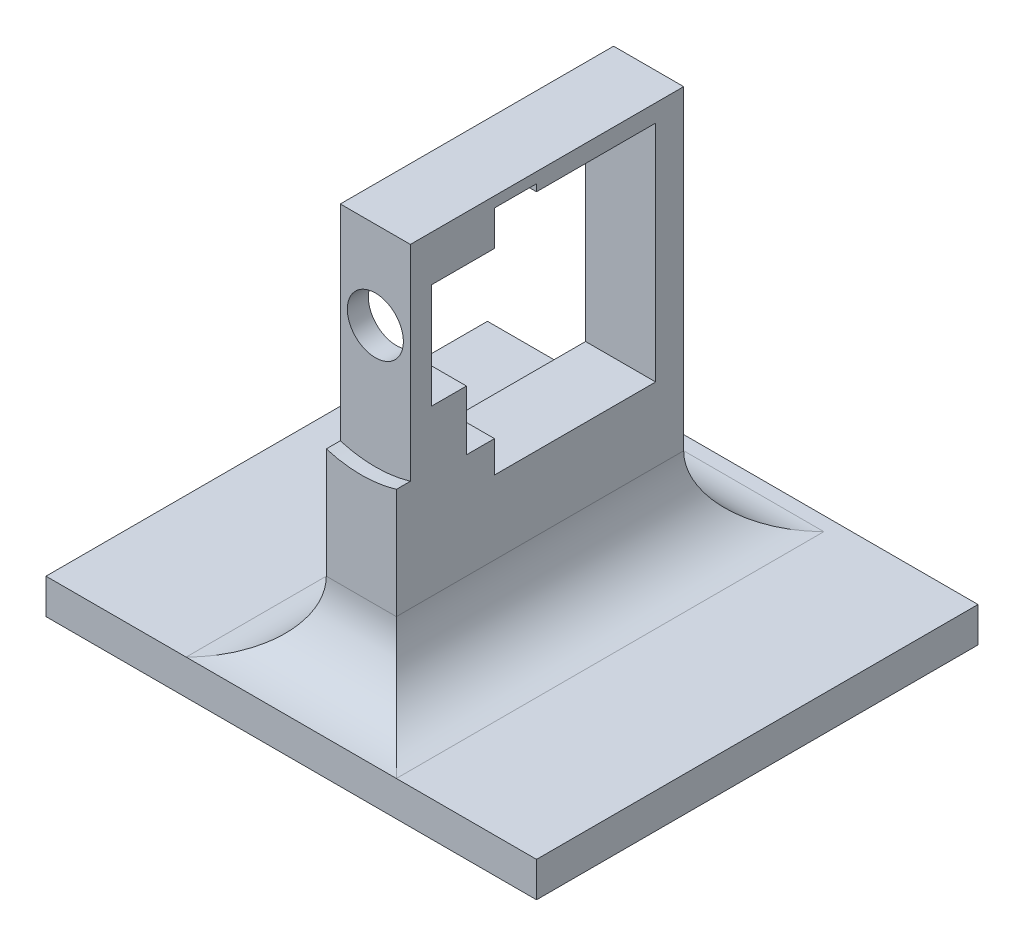
ISO-10303-21;
HEADER;
FILE_DESCRIPTION(('STEP AP214'),'2;1');
FILE_NAME('part.step','',(''),(''),'','','');
FILE_SCHEMA(('AUTOMOTIVE_DESIGN { 1 0 10303 214 1 1 1 1 }'));
ENDSEC;
DATA;
#1=APPLICATION_CONTEXT('core data for automotive mechanical design processes');
#2=APPLICATION_PROTOCOL_DEFINITION('international standard','automotive_design',2000,#1);
#3=PRODUCT_CONTEXT('',#1,'mechanical');
#4=PRODUCT('Part','Part','',(#3));
#5=PRODUCT_RELATED_PRODUCT_CATEGORY('part','',(#4));
#6=PRODUCT_DEFINITION_FORMATION('','',#4);
#7=PRODUCT_DEFINITION_CONTEXT('part definition',#1,'design');
#8=PRODUCT_DEFINITION('design','',#6,#7);
#9=PRODUCT_DEFINITION_SHAPE('','',#8);
#10=(LENGTH_UNIT() NAMED_UNIT(*) SI_UNIT(.MILLI.,.METRE.));
#11=(NAMED_UNIT(*) PLANE_ANGLE_UNIT() SI_UNIT($,.RADIAN.));
#12=(NAMED_UNIT(*) SI_UNIT($,.STERADIAN.) SOLID_ANGLE_UNIT());
#13=UNCERTAINTY_MEASURE_WITH_UNIT(LENGTH_MEASURE(1.E-05),#10,'distance_accuracy_value','');
#14=(GEOMETRIC_REPRESENTATION_CONTEXT(3) GLOBAL_UNCERTAINTY_ASSIGNED_CONTEXT((#13)) GLOBAL_UNIT_ASSIGNED_CONTEXT((#10,
#11,#12)) REPRESENTATION_CONTEXT('',''));
#15=CARTESIAN_POINT('',(0.,0.,0.));
#16=DIRECTION('',(0.,0.,1.));
#17=DIRECTION('',(1.,0.,0.));
#18=AXIS2_PLACEMENT_3D('',#15,#16,#17);
#19=CARTESIAN_POINT('',(5.,2.5,-10.));
#20=DIRECTION('',(1.,0.,0.));
#21=DIRECTION('',(0.,1.,0.));
#22=AXIS2_PLACEMENT_3D('',#19,#20,#21);
#23=PLANE('',#22);
#24=DIRECTION('',(0.,1.,0.));
#25=VECTOR('',#24,1.);
#26=CARTESIAN_POINT('',(5.,2.5,10.));
#27=LINE('',#26,#25);
#28=CARTESIAN_POINT('',(5.,12.5,10.));
#29=VERTEX_POINT('',#28);
#30=CARTESIAN_POINT('',(5.,28.2294901687516,10.));
#31=VERTEX_POINT('',#30);
#32=EDGE_CURVE('E332',#29,#31,#27,.T.);
#33=ORIENTED_EDGE('',*,*,#32,.F.);
#34=DIRECTION('',(0.,0.,1.));
#35=VECTOR('',#34,1.);
#36=CARTESIAN_POINT('',(5.,12.5,-31.));
#37=LINE('',#36,#35);
#38=CARTESIAN_POINT('',(5.,12.5,-31.));
#39=VERTEX_POINT('',#38);
#40=EDGE_CURVE('E11',#29,#39,#37,.F.);
#41=ORIENTED_EDGE('',*,*,#40,.T.);
#42=DIRECTION('',(0.,-1.,0.));
#43=VECTOR('',#42,1.);
#44=CARTESIAN_POINT('',(5.,0.,-31.));
#45=LINE('',#44,#43);
#46=CARTESIAN_POINT('',(5.,57.5,-31.));
#47=VERTEX_POINT('',#46);
#48=EDGE_CURVE('E218',#47,#39,#45,.T.);
#49=ORIENTED_EDGE('',*,*,#48,.F.);
#50=DIRECTION('',(0.,0.,1.));
#51=VECTOR('',#50,1.);
#52=CARTESIAN_POINT('',(5.,57.5,-10.));
#53=LINE('',#52,#51);
#54=CARTESIAN_POINT('',(5.,57.5,8.));
#55=VERTEX_POINT('',#54);
#56=EDGE_CURVE('E209',#47,#55,#53,.T.);
#57=ORIENTED_EDGE('',*,*,#56,.T.);
#58=DIRECTION('',(0.,-1.,0.));
#59=VECTOR('',#58,1.);
#60=CARTESIAN_POINT('',(5.,2.5,8.));
#61=LINE('',#60,#59);
#62=CARTESIAN_POINT('',(5.,28.2294901687516,8.));
#63=VERTEX_POINT('',#62);
#64=EDGE_CURVE('E329',#55,#63,#61,.T.);
#65=ORIENTED_EDGE('',*,*,#64,.T.);
#66=DIRECTION('',(0.,0.,-1.));
#67=VECTOR('',#66,1.);
#68=CARTESIAN_POINT('',(5.,28.2294901687516,20.));
#69=LINE('',#68,#67);
#70=EDGE_CURVE('E325',#63,#31,#69,.F.);
#71=ORIENTED_EDGE('',*,*,#70,.T.);
#72=EDGE_LOOP('',(#33,#41,#49,#57,#65,#71));
#73=FACE_BOUND('',#72,.T.);
#74=DIRECTION('',(0.,-1.,0.));
#75=VECTOR('',#74,1.);
#76=CARTESIAN_POINT('',(5.,0.,-3.99999999999999));
#77=LINE('',#76,#75);
#78=CARTESIAN_POINT('',(5.,56.,-4.));
#79=VERTEX_POINT('',#78);
#80=CARTESIAN_POINT('',(5.,51.,-4.));
#81=VERTEX_POINT('',#80);
#82=EDGE_CURVE('E301',#79,#81,#77,.T.);
#83=ORIENTED_EDGE('',*,*,#82,.F.);
#84=DIRECTION('',(0.,0.,1.));
#85=VECTOR('',#84,1.);
#86=CARTESIAN_POINT('',(5.,56.,-1.29526019539602E-13));
#87=LINE('',#86,#85);
#88=CARTESIAN_POINT('',(5.,56.,-10.));
#89=VERTEX_POINT('',#88);
#90=EDGE_CURVE('E296',#89,#79,#87,.T.);
#91=ORIENTED_EDGE('',*,*,#90,.F.);
#92=DIRECTION('',(0.,-1.,0.));
#93=VECTOR('',#92,1.);
#94=CARTESIAN_POINT('',(5.,0.,-10.));
#95=LINE('',#94,#93);
#96=CARTESIAN_POINT('',(5.,55.,-10.));
#97=VERTEX_POINT('',#96);
#98=EDGE_CURVE('E240',#89,#97,#95,.T.);
#99=ORIENTED_EDGE('',*,*,#98,.T.);
#100=DIRECTION('',(0.,0.,-1.));
#101=VECTOR('',#100,1.);
#102=CARTESIAN_POINT('',(5.,55.,0.));
#103=LINE('',#102,#101);
#104=CARTESIAN_POINT('',(5.,55.,-27.));
#105=VERTEX_POINT('',#104);
#106=EDGE_CURVE('E232',#97,#105,#103,.T.);
#107=ORIENTED_EDGE('',*,*,#106,.T.);
#108=DIRECTION('',(0.,-1.,0.));
#109=VECTOR('',#108,1.);
#110=CARTESIAN_POINT('',(5.,0.,-27.));
#111=LINE('',#110,#109);
#112=CARTESIAN_POINT('',(5.,23.,-27.));
#113=VERTEX_POINT('',#112);
#114=EDGE_CURVE('E226',#105,#113,#111,.T.);
#115=ORIENTED_EDGE('',*,*,#114,.T.);
#116=DIRECTION('',(0.,0.,1.));
#117=VECTOR('',#116,1.);
#118=CARTESIAN_POINT('',(5.,23.,0.));
#119=LINE('',#118,#117);
#120=CARTESIAN_POINT('',(5.,23.,-4.));
#121=VERTEX_POINT('',#120);
#122=EDGE_CURVE('E262',#113,#121,#119,.T.);
#123=ORIENTED_EDGE('',*,*,#122,.T.);
#124=DIRECTION('',(0.,-1.,0.));
#125=VECTOR('',#124,1.);
#126=CARTESIAN_POINT('',(5.,0.,-3.99999999999999));
#127=LINE('',#126,#125);
#128=CARTESIAN_POINT('',(5.,27.5,-4.));
#129=VERTEX_POINT('',#128);
#130=EDGE_CURVE('E253',#129,#121,#127,.T.);
#131=ORIENTED_EDGE('',*,*,#130,.F.);
#132=DIRECTION('',(0.,0.,1.));
#133=VECTOR('',#132,1.);
#134=CARTESIAN_POINT('',(5.,27.5,0.));
#135=LINE('',#134,#133);
#136=CARTESIAN_POINT('',(5.00000000000002,27.5,0.));
#137=VERTEX_POINT('',#136);
#138=EDGE_CURVE('E257',#129,#137,#135,.T.);
#139=ORIENTED_EDGE('',*,*,#138,.T.);
#140=DIRECTION('',(0.,-1.,0.));
#141=VECTOR('',#140,1.);
#142=CARTESIAN_POINT('',(5.,0.,0.));
#143=LINE('',#142,#141);
#144=CARTESIAN_POINT('',(5.,36.,0.));
#145=VERTEX_POINT('',#144);
#146=EDGE_CURVE('E286',#145,#137,#143,.T.);
#147=ORIENTED_EDGE('',*,*,#146,.F.);
#148=DIRECTION('',(0.,0.,1.));
#149=VECTOR('',#148,1.);
#150=CARTESIAN_POINT('',(5.,36.,0.));
#151=LINE('',#150,#149);
#152=CARTESIAN_POINT('',(5.,36.,5.));
#153=VERTEX_POINT('',#152);
#154=EDGE_CURVE('E282',#145,#153,#151,.T.);
#155=ORIENTED_EDGE('',*,*,#154,.T.);
#156=DIRECTION('',(0.,-1.,0.));
#157=VECTOR('',#156,1.);
#158=CARTESIAN_POINT('',(5.,0.,5.00000000000001));
#159=LINE('',#158,#157);
#160=CARTESIAN_POINT('',(5.,51.,5.));
#161=VERTEX_POINT('',#160);
#162=EDGE_CURVE('E305',#161,#153,#159,.T.);
#163=ORIENTED_EDGE('',*,*,#162,.F.);
#164=DIRECTION('',(0.,0.,1.));
#165=VECTOR('',#164,1.);
#166=CARTESIAN_POINT('',(5.,51.,0.));
#167=LINE('',#166,#165);
#168=EDGE_CURVE('E303',#81,#161,#167,.T.);
#169=ORIENTED_EDGE('',*,*,#168,.F.);
#170=EDGE_LOOP('',(#83,#91,#99,#107,#115,#123,#131,#139,#147,#155,#163,#169));
#171=FACE_BOUND('',#170,.T.);
#172=ADVANCED_FACE('F37',(#73,#171),#23,.T.);
#173=CARTESIAN_POINT('',(-5.,2.5,-10.));
#174=DIRECTION('',(-1.,0.,0.));
#175=DIRECTION('',(0.,-1.,0.));
#176=AXIS2_PLACEMENT_3D('',#173,#174,#175);
#177=PLANE('',#176);
#178=DIRECTION('',(0.,-1.,0.));
#179=VECTOR('',#178,1.);
#180=CARTESIAN_POINT('',(-5.,0.,-10.));
#181=LINE('',#180,#179);
#182=CARTESIAN_POINT('',(-5.,56.,-10.));
#183=VERTEX_POINT('',#182);
#184=CARTESIAN_POINT('',(-5.,55.,-10.));
#185=VERTEX_POINT('',#184);
#186=EDGE_CURVE('E219',#183,#185,#181,.T.);
#187=ORIENTED_EDGE('',*,*,#186,.F.);
#188=DIRECTION('',(0.,0.,1.));
#189=VECTOR('',#188,1.);
#190=CARTESIAN_POINT('',(-5.00000000000001,56.,-1.29526019539602E-13));
#191=LINE('',#190,#189);
#192=CARTESIAN_POINT('',(-5.00000000000001,56.,-4.));
#193=VERTEX_POINT('',#192);
#194=EDGE_CURVE('E259',#183,#193,#191,.T.);
#195=ORIENTED_EDGE('',*,*,#194,.T.);
#196=DIRECTION('',(0.,-1.,0.));
#197=VECTOR('',#196,1.);
#198=CARTESIAN_POINT('',(-5.,0.,-3.99999999999999));
#199=LINE('',#198,#197);
#200=CARTESIAN_POINT('',(-5.00000000000001,51.,-4.));
#201=VERTEX_POINT('',#200);
#202=EDGE_CURVE('E264',#193,#201,#199,.T.);
#203=ORIENTED_EDGE('',*,*,#202,.T.);
#204=DIRECTION('',(0.,0.,1.));
#205=VECTOR('',#204,1.);
#206=CARTESIAN_POINT('',(-5.00000000000001,51.,0.));
#207=LINE('',#206,#205);
#208=CARTESIAN_POINT('',(-5.00000000000001,51.,5.));
#209=VERTEX_POINT('',#208);
#210=EDGE_CURVE('E268',#201,#209,#207,.T.);
#211=ORIENTED_EDGE('',*,*,#210,.T.);
#212=DIRECTION('',(0.,-1.,0.));
#213=VECTOR('',#212,1.);
#214=CARTESIAN_POINT('',(-5.,0.,5.00000000000001));
#215=LINE('',#214,#213);
#216=CARTESIAN_POINT('',(-5.,36.,5.));
#217=VERTEX_POINT('',#216);
#218=EDGE_CURVE('E272',#209,#217,#215,.T.);
#219=ORIENTED_EDGE('',*,*,#218,.T.);
#220=DIRECTION('',(0.,0.,1.));
#221=VECTOR('',#220,1.);
#222=CARTESIAN_POINT('',(-5.,36.,0.));
#223=LINE('',#222,#221);
#224=CARTESIAN_POINT('',(-5.,36.,0.));
#225=VERTEX_POINT('',#224);
#226=EDGE_CURVE('E258',#225,#217,#223,.T.);
#227=ORIENTED_EDGE('',*,*,#226,.F.);
#228=DIRECTION('',(0.,-1.,0.));
#229=VECTOR('',#228,1.);
#230=CARTESIAN_POINT('',(-5.,0.,0.));
#231=LINE('',#230,#229);
#232=CARTESIAN_POINT('',(-5.,27.5,0.));
#233=VERTEX_POINT('',#232);
#234=EDGE_CURVE('E279',#225,#233,#231,.T.);
#235=ORIENTED_EDGE('',*,*,#234,.T.);
#236=DIRECTION('',(0.,0.,1.));
#237=VECTOR('',#236,1.);
#238=CARTESIAN_POINT('',(-5.,27.5,0.));
#239=LINE('',#238,#237);
#240=CARTESIAN_POINT('',(-5.,27.5,-4.));
#241=VERTEX_POINT('',#240);
#242=EDGE_CURVE('E278',#241,#233,#239,.T.);
#243=ORIENTED_EDGE('',*,*,#242,.F.);
#244=DIRECTION('',(0.,-1.,0.));
#245=VECTOR('',#244,1.);
#246=CARTESIAN_POINT('',(-5.,0.,-3.99999999999999));
#247=LINE('',#246,#245);
#248=CARTESIAN_POINT('',(-5.,23.,-4.));
#249=VERTEX_POINT('',#248);
#250=EDGE_CURVE('E287',#241,#249,#247,.T.);
#251=ORIENTED_EDGE('',*,*,#250,.T.);
#252=DIRECTION('',(0.,0.,1.));
#253=VECTOR('',#252,1.);
#254=CARTESIAN_POINT('',(-5.,23.,0.));
#255=LINE('',#254,#253);
#256=CARTESIAN_POINT('',(-5.,23.,-27.));
#257=VERTEX_POINT('',#256);
#258=EDGE_CURVE('E254',#257,#249,#255,.T.);
#259=ORIENTED_EDGE('',*,*,#258,.F.);
#260=DIRECTION('',(0.,-1.,0.));
#261=VECTOR('',#260,1.);
#262=CARTESIAN_POINT('',(-5.,0.,-27.));
#263=LINE('',#262,#261);
#264=CARTESIAN_POINT('',(-5.,55.,-27.));
#265=VERTEX_POINT('',#264);
#266=EDGE_CURVE('E236',#265,#257,#263,.T.);
#267=ORIENTED_EDGE('',*,*,#266,.F.);
#268=DIRECTION('',(0.,0.,-1.));
#269=VECTOR('',#268,1.);
#270=CARTESIAN_POINT('',(-5.,55.,0.));
#271=LINE('',#270,#269);
#272=EDGE_CURVE('E246',#185,#265,#271,.T.);
#273=ORIENTED_EDGE('',*,*,#272,.F.);
#274=EDGE_LOOP('',(#187,#195,#203,#211,#219,#227,#235,#243,#251,#259,#267,#273));
#275=FACE_BOUND('',#274,.T.);
#276=DIRECTION('',(0.,-1.,0.));
#277=VECTOR('',#276,1.);
#278=CARTESIAN_POINT('',(-5.,0.,-31.));
#279=LINE('',#278,#277);
#280=CARTESIAN_POINT('',(-5.,57.5,-31.));
#281=VERTEX_POINT('',#280);
#282=CARTESIAN_POINT('',(-5.,12.5,-31.));
#283=VERTEX_POINT('',#282);
#284=EDGE_CURVE('E203',#281,#283,#279,.T.);
#285=ORIENTED_EDGE('',*,*,#284,.T.);
#286=DIRECTION('',(0.,0.,1.));
#287=VECTOR('',#286,1.);
#288=CARTESIAN_POINT('',(-5.,12.5,10.));
#289=LINE('',#288,#287);
#290=CARTESIAN_POINT('',(-5.,12.5,10.));
#291=VERTEX_POINT('',#290);
#292=EDGE_CURVE('E61',#283,#291,#289,.T.);
#293=ORIENTED_EDGE('',*,*,#292,.T.);
#294=DIRECTION('',(0.,-1.,0.));
#295=VECTOR('',#294,1.);
#296=CARTESIAN_POINT('',(-5.,2.5,10.));
#297=LINE('',#296,#295);
#298=CARTESIAN_POINT('',(-5.,28.2294901687516,10.));
#299=VERTEX_POINT('',#298);
#300=EDGE_CURVE('E334',#299,#291,#297,.T.);
#301=ORIENTED_EDGE('',*,*,#300,.F.);
#302=DIRECTION('',(0.,0.,-1.));
#303=VECTOR('',#302,1.);
#304=CARTESIAN_POINT('',(-5.,28.2294901687516,20.));
#305=LINE('',#304,#303);
#306=CARTESIAN_POINT('',(-5.,28.2294901687516,8.));
#307=VERTEX_POINT('',#306);
#308=EDGE_CURVE('E323',#299,#307,#305,.T.);
#309=ORIENTED_EDGE('',*,*,#308,.T.);
#310=DIRECTION('',(0.,1.,0.));
#311=VECTOR('',#310,1.);
#312=CARTESIAN_POINT('',(-5.,2.5,8.));
#313=LINE('',#312,#311);
#314=CARTESIAN_POINT('',(-5.,57.5,8.));
#315=VERTEX_POINT('',#314);
#316=EDGE_CURVE('E205',#307,#315,#313,.T.);
#317=ORIENTED_EDGE('',*,*,#316,.T.);
#318=DIRECTION('',(0.,0.,1.));
#319=VECTOR('',#318,1.);
#320=CARTESIAN_POINT('',(-5.,57.5,-10.));
#321=LINE('',#320,#319);
#322=EDGE_CURVE('E199',#281,#315,#321,.T.);
#323=ORIENTED_EDGE('',*,*,#322,.F.);
#324=EDGE_LOOP('',(#285,#293,#301,#309,#317,#323));
#325=FACE_BOUND('',#324,.T.);
#326=ADVANCED_FACE('F201',(#275,#325),#177,.T.);
#327=CARTESIAN_POINT('',(5.,57.5,-10.));
#328=DIRECTION('',(0.,1.,0.));
#329=DIRECTION('',(0.,0.,1.));
#330=AXIS2_PLACEMENT_3D('',#327,#328,#329);
#331=PLANE('',#330);
#332=ORIENTED_EDGE('',*,*,#322,.T.);
#333=DIRECTION('',(1.,0.,0.));
#334=VECTOR('',#333,1.);
#335=CARTESIAN_POINT('',(5.,57.5,8.));
#336=LINE('',#335,#334);
#337=EDGE_CURVE('E374',#315,#55,#336,.T.);
#338=ORIENTED_EDGE('',*,*,#337,.T.);
#339=ORIENTED_EDGE('',*,*,#56,.F.);
#340=DIRECTION('',(-1.,0.,0.));
#341=VECTOR('',#340,1.);
#342=CARTESIAN_POINT('',(63.8727441181401,57.5,-31.));
#343=LINE('',#342,#341);
#344=EDGE_CURVE('E212',#47,#281,#343,.T.);
#345=ORIENTED_EDGE('',*,*,#344,.T.);
#346=EDGE_LOOP('',(#332,#338,#339,#345));
#347=FACE_BOUND('',#346,.T.);
#348=ADVANCED_FACE('F213',(#347),#331,.T.);
#349=CARTESIAN_POINT('',(-35.,2.5,-43.));
#350=DIRECTION('',(0.,1.,0.));
#351=DIRECTION('',(0.,0.,1.));
#352=AXIS2_PLACEMENT_3D('',#349,#350,#351);
#353=PLANE('',#352);
#354=DIRECTION('',(-1.,0.,0.));
#355=VECTOR('',#354,1.);
#356=CARTESIAN_POINT('',(-35.,2.5,20.));
#357=LINE('',#356,#355);
#358=CARTESIAN_POINT('',(-15.,2.5,20.));
#359=VERTEX_POINT('',#358);
#360=CARTESIAN_POINT('',(-35.,2.5,20.));
#361=VERTEX_POINT('',#360);
#362=EDGE_CURVE('E339',#359,#361,#357,.T.);
#363=ORIENTED_EDGE('',*,*,#362,.F.);
#364=DIRECTION('',(0.,0.,1.));
#365=VECTOR('',#364,1.);
#366=CARTESIAN_POINT('',(-15.,2.5,-31.));
#367=LINE('',#366,#365);
#368=CARTESIAN_POINT('',(-15.,2.5,-41.));
#369=VERTEX_POINT('',#368);
#370=EDGE_CURVE('E388',#359,#369,#367,.F.);
#371=ORIENTED_EDGE('',*,*,#370,.T.);
#372=DIRECTION('',(-1.,0.,0.));
#373=VECTOR('',#372,1.);
#374=CARTESIAN_POINT('',(5.,2.5,-41.));
#375=LINE('',#374,#373);
#376=CARTESIAN_POINT('',(15.,2.5,-41.));
#377=VERTEX_POINT('',#376);
#378=EDGE_CURVE('E385',#369,#377,#375,.F.);
#379=ORIENTED_EDGE('',*,*,#378,.T.);
#380=DIRECTION('',(0.,0.,1.));
#381=VECTOR('',#380,1.);
#382=CARTESIAN_POINT('',(15.,2.5,10.));
#383=LINE('',#382,#381);
#384=CARTESIAN_POINT('',(15.,2.5,20.));
#385=VERTEX_POINT('',#384);
#386=EDGE_CURVE('E383',#377,#385,#383,.T.);
#387=ORIENTED_EDGE('',*,*,#386,.T.);
#388=CARTESIAN_POINT('',(35.,2.5,20.));
#389=VERTEX_POINT('',#388);
#390=EDGE_CURVE('E340',#389,#385,#357,.T.);
#391=ORIENTED_EDGE('',*,*,#390,.F.);
#392=DIRECTION('',(0.,0.,1.));
#393=VECTOR('',#392,1.);
#394=CARTESIAN_POINT('',(35.,2.5,-43.));
#395=LINE('',#394,#393);
#396=CARTESIAN_POINT('',(35.,2.5,-43.));
#397=VERTEX_POINT('',#396);
#398=EDGE_CURVE('E362',#397,#389,#395,.T.);
#399=ORIENTED_EDGE('',*,*,#398,.F.);
#400=DIRECTION('',(-1.,0.,0.));
#401=VECTOR('',#400,1.);
#402=CARTESIAN_POINT('',(-35.,2.5,-43.));
#403=LINE('',#402,#401);
#404=CARTESIAN_POINT('',(-35.,2.5,-43.));
#405=VERTEX_POINT('',#404);
#406=EDGE_CURVE('E353',#397,#405,#403,.T.);
#407=ORIENTED_EDGE('',*,*,#406,.T.);
#408=DIRECTION('',(0.,0.,1.));
#409=VECTOR('',#408,1.);
#410=CARTESIAN_POINT('',(-35.,2.5,-43.));
#411=LINE('',#410,#409);
#412=EDGE_CURVE('E368',#405,#361,#411,.T.);
#413=ORIENTED_EDGE('',*,*,#412,.T.);
#414=EDGE_LOOP('',(#363,#371,#379,#387,#391,#399,#407,#413));
#415=FACE_BOUND('',#414,.T.);
#416=ADVANCED_FACE('F415',(#415),#353,.T.);
#417=CARTESIAN_POINT('',(35.,2.5,-43.));
#418=DIRECTION('',(1.,0.,0.));
#419=DIRECTION('',(0.,0.,-1.));
#420=AXIS2_PLACEMENT_3D('',#417,#418,#419);
#421=PLANE('',#420);
#422=ORIENTED_EDGE('',*,*,#398,.T.);
#423=DIRECTION('',(0.,1.,0.));
#424=VECTOR('',#423,1.);
#425=CARTESIAN_POINT('',(35.,2.5,20.));
#426=LINE('',#425,#424);
#427=CARTESIAN_POINT('',(35.,-2.5,20.));
#428=VERTEX_POINT('',#427);
#429=EDGE_CURVE('E208',#428,#389,#426,.T.);
#430=ORIENTED_EDGE('',*,*,#429,.F.);
#431=DIRECTION('',(0.,0.,1.));
#432=VECTOR('',#431,1.);
#433=CARTESIAN_POINT('',(35.,-2.5,-43.));
#434=LINE('',#433,#432);
#435=CARTESIAN_POINT('',(35.,-2.5,-43.));
#436=VERTEX_POINT('',#435);
#437=EDGE_CURVE('E363',#436,#428,#434,.T.);
#438=ORIENTED_EDGE('',*,*,#437,.F.);
#439=DIRECTION('',(0.,1.,0.));
#440=VECTOR('',#439,1.);
#441=CARTESIAN_POINT('',(35.,2.5,-43.));
#442=LINE('',#441,#440);
#443=EDGE_CURVE('E350',#436,#397,#442,.T.);
#444=ORIENTED_EDGE('',*,*,#443,.T.);
#445=EDGE_LOOP('',(#422,#430,#438,#444));
#446=FACE_BOUND('',#445,.T.);
#447=ADVANCED_FACE('F425',(#446),#421,.T.);
#448=CARTESIAN_POINT('',(-35.,-2.5,-43.));
#449=DIRECTION('',(0.,-1.,0.));
#450=DIRECTION('',(0.,0.,-1.));
#451=AXIS2_PLACEMENT_3D('',#448,#449,#450);
#452=PLANE('',#451);
#453=ORIENTED_EDGE('',*,*,#437,.T.);
#454=DIRECTION('',(1.,0.,0.));
#455=VECTOR('',#454,1.);
#456=CARTESIAN_POINT('',(-35.,-2.5,20.));
#457=LINE('',#456,#455);
#458=CARTESIAN_POINT('',(-35.,-2.5,20.));
#459=VERTEX_POINT('',#458);
#460=EDGE_CURVE('E347',#459,#428,#457,.T.);
#461=ORIENTED_EDGE('',*,*,#460,.F.);
#462=DIRECTION('',(0.,0.,1.));
#463=VECTOR('',#462,1.);
#464=CARTESIAN_POINT('',(-35.,-2.5,-43.));
#465=LINE('',#464,#463);
#466=CARTESIAN_POINT('',(-35.,-2.5,-43.));
#467=VERTEX_POINT('',#466);
#468=EDGE_CURVE('E366',#467,#459,#465,.T.);
#469=ORIENTED_EDGE('',*,*,#468,.F.);
#470=DIRECTION('',(1.,0.,0.));
#471=VECTOR('',#470,1.);
#472=CARTESIAN_POINT('',(-35.,-2.5,-43.));
#473=LINE('',#472,#471);
#474=EDGE_CURVE('E359',#467,#436,#473,.T.);
#475=ORIENTED_EDGE('',*,*,#474,.T.);
#476=EDGE_LOOP('',(#453,#461,#469,#475));
#477=FACE_BOUND('',#476,.T.);
#478=ADVANCED_FACE('F422',(#477),#452,.T.);
#479=CARTESIAN_POINT('',(-35.,2.5,-43.));
#480=DIRECTION('',(-1.,0.,0.));
#481=DIRECTION('',(0.,0.,1.));
#482=AXIS2_PLACEMENT_3D('',#479,#480,#481);
#483=PLANE('',#482);
#484=ORIENTED_EDGE('',*,*,#468,.T.);
#485=DIRECTION('',(0.,-1.,0.));
#486=VECTOR('',#485,1.);
#487=CARTESIAN_POINT('',(-35.,2.5,20.));
#488=LINE('',#487,#486);
#489=EDGE_CURVE('E343',#361,#459,#488,.T.);
#490=ORIENTED_EDGE('',*,*,#489,.F.);
#491=ORIENTED_EDGE('',*,*,#412,.F.);
#492=DIRECTION('',(0.,-1.,0.));
#493=VECTOR('',#492,1.);
#494=CARTESIAN_POINT('',(-35.,2.5,-43.));
#495=LINE('',#494,#493);
#496=EDGE_CURVE('E356',#405,#467,#495,.T.);
#497=ORIENTED_EDGE('',*,*,#496,.T.);
#498=EDGE_LOOP('',(#484,#490,#491,#497));
#499=FACE_BOUND('',#498,.T.);
#500=ADVANCED_FACE('F419',(#499),#483,.T.);
#501=CARTESIAN_POINT('',(0.,0.,-43.));
#502=DIRECTION('',(0.,0.,1.));
#503=DIRECTION('',(1.,0.,0.));
#504=AXIS2_PLACEMENT_3D('',#501,#502,#503);
#505=PLANE('',#504);
#506=ORIENTED_EDGE('',*,*,#443,.F.);
#507=ORIENTED_EDGE('',*,*,#474,.F.);
#508=ORIENTED_EDGE('',*,*,#496,.F.);
#509=ORIENTED_EDGE('',*,*,#406,.F.);
#510=EDGE_LOOP('',(#506,#507,#508,#509));
#511=FACE_BOUND('',#510,.T.);
#512=ADVANCED_FACE('F454',(#511),#505,.F.);
#513=CARTESIAN_POINT('',(0.,0.,20.));
#514=DIRECTION('',(0.,0.,1.));
#515=DIRECTION('',(1.,0.,0.));
#516=AXIS2_PLACEMENT_3D('',#513,#514,#515);
#517=PLANE('',#516);
#518=ORIENTED_EDGE('',*,*,#429,.T.);
#519=ORIENTED_EDGE('',*,*,#390,.T.);
#520=EDGE_CURVE('E344',#385,#359,#357,.T.);
#521=ORIENTED_EDGE('',*,*,#520,.T.);
#522=ORIENTED_EDGE('',*,*,#362,.T.);
#523=ORIENTED_EDGE('',*,*,#489,.T.);
#524=ORIENTED_EDGE('',*,*,#460,.T.);
#525=EDGE_LOOP('',(#518,#519,#521,#522,#523,#524));
#526=FACE_BOUND('',#525,.T.);
#527=ADVANCED_FACE('F411',(#526),#517,.T.);
#528=CARTESIAN_POINT('',(0.,0.,10.));
#529=DIRECTION('',(0.,0.,1.));
#530=DIRECTION('',(1.,0.,0.));
#531=AXIS2_PLACEMENT_3D('',#528,#529,#530);
#532=PLANE('',#531);
#533=ORIENTED_EDGE('',*,*,#300,.T.);
#534=DIRECTION('',(1.,0.,0.));
#535=VECTOR('',#534,1.);
#536=CARTESIAN_POINT('',(5.,12.5,10.));
#537=LINE('',#536,#535);
#538=EDGE_CURVE('E46',#291,#29,#537,.T.);
#539=ORIENTED_EDGE('',*,*,#538,.T.);
#540=ORIENTED_EDGE('',*,*,#32,.T.);
#541=CARTESIAN_POINT('',(0.,45.,10.));
#542=DIRECTION('',(0.,0.,1.));
#543=DIRECTION('',(1.,0.,0.));
#544=AXIS2_PLACEMENT_3D('',#541,#542,#543);
#545=CIRCLE('',#544,17.5);
#546=EDGE_CURVE('E365',#31,#299,#545,.F.);
#547=ORIENTED_EDGE('',*,*,#546,.T.);
#548=EDGE_LOOP('',(#533,#539,#540,#547));
#549=FACE_BOUND('',#548,.T.);
#550=ADVANCED_FACE('F453',(#549),#532,.T.);
#551=CARTESIAN_POINT('',(0.,45.,20.));
#552=DIRECTION('',(0.,0.,-1.));
#553=DIRECTION('',(-1.,0.,0.));
#554=AXIS2_PLACEMENT_3D('',#551,#552,#553);
#555=CYLINDRICAL_SURFACE('',#554,17.5);
#556=CARTESIAN_POINT('',(0.,45.,8.));
#557=DIRECTION('',(0.,0.,1.));
#558=DIRECTION('',(1.,0.,0.));
#559=AXIS2_PLACEMENT_3D('',#556,#557,#558);
#560=CIRCLE('',#559,17.5);
#561=EDGE_CURVE('E290',#307,#63,#560,.T.);
#562=ORIENTED_EDGE('',*,*,#561,.F.);
#563=ORIENTED_EDGE('',*,*,#308,.F.);
#564=ORIENTED_EDGE('',*,*,#546,.F.);
#565=ORIENTED_EDGE('',*,*,#70,.F.);
#566=EDGE_LOOP('',(#562,#563,#564,#565));
#567=FACE_BOUND('',#566,.T.);
#568=ADVANCED_FACE('F540',(#567),#555,.F.);
#569=CARTESIAN_POINT('',(0.,0.,8.));
#570=DIRECTION('',(0.,0.,1.));
#571=DIRECTION('',(1.,0.,0.));
#572=AXIS2_PLACEMENT_3D('',#569,#570,#571);
#573=PLANE('',#572);
#574=CARTESIAN_POINT('',(0.,45.,8.));
#575=DIRECTION('',(0.,0.,1.));
#576=DIRECTION('',(1.,0.,0.));
#577=AXIS2_PLACEMENT_3D('',#574,#575,#576);
#578=CIRCLE('',#577,4.);
#579=CARTESIAN_POINT('',(4.,45.,8.));
#580=VERTEX_POINT('',#579);
#581=EDGE_CURVE('E250',#580,#580,#578,.T.);
#582=ORIENTED_EDGE('',*,*,#581,.F.);
#583=EDGE_LOOP('',(#582));
#584=FACE_BOUND('',#583,.T.);
#585=ORIENTED_EDGE('',*,*,#337,.F.);
#586=ORIENTED_EDGE('',*,*,#316,.F.);
#587=ORIENTED_EDGE('',*,*,#561,.T.);
#588=ORIENTED_EDGE('',*,*,#64,.F.);
#589=EDGE_LOOP('',(#585,#586,#587,#588));
#590=FACE_BOUND('',#589,.T.);
#591=ADVANCED_FACE('F526',(#584,#590),#573,.T.);
#592=CARTESIAN_POINT('',(41.2491379207837,0.,5.00000000000001));
#593=DIRECTION('',(0.,0.,-1.));
#594=DIRECTION('',(0.,1.,0.));
#595=AXIS2_PLACEMENT_3D('',#592,#593,#594);
#596=PLANE('',#595);
#597=CARTESIAN_POINT('',(0.,45.,5.));
#598=DIRECTION('',(0.,0.,-1.));
#599=DIRECTION('',(0.,1.,0.));
#600=AXIS2_PLACEMENT_3D('',#597,#598,#599);
#601=CIRCLE('',#600,4.);
#602=CARTESIAN_POINT('',(0.,49.,5.));
#603=VERTEX_POINT('',#602);
#604=EDGE_CURVE('E239',#603,#603,#601,.T.);
#605=ORIENTED_EDGE('',*,*,#604,.F.);
#606=EDGE_LOOP('',(#605));
#607=FACE_BOUND('',#606,.T.);
#608=ORIENTED_EDGE('',*,*,#162,.T.);
#609=DIRECTION('',(-1.,0.,0.));
#610=VECTOR('',#609,1.);
#611=CARTESIAN_POINT('',(41.2491379207837,36.,5.));
#612=LINE('',#611,#610);
#613=EDGE_CURVE('E309',#153,#217,#612,.T.);
#614=ORIENTED_EDGE('',*,*,#613,.T.);
#615=ORIENTED_EDGE('',*,*,#218,.F.);
#616=DIRECTION('',(-1.,0.,0.));
#617=VECTOR('',#616,1.);
#618=CARTESIAN_POINT('',(41.2491379207837,51.,5.));
#619=LINE('',#618,#617);
#620=EDGE_CURVE('E275',#161,#209,#619,.T.);
#621=ORIENTED_EDGE('',*,*,#620,.F.);
#622=EDGE_LOOP('',(#608,#614,#615,#621));
#623=FACE_BOUND('',#622,.T.);
#624=ADVANCED_FACE('F522',(#607,#623),#596,.T.);
#625=CARTESIAN_POINT('',(41.2491379207837,27.5,0.));
#626=DIRECTION('',(0.,-1.,0.));
#627=DIRECTION('',(1.,0.,0.));
#628=AXIS2_PLACEMENT_3D('',#625,#626,#627);
#629=PLANE('',#628);
#630=DIRECTION('',(-1.,0.,0.));
#631=VECTOR('',#630,1.);
#632=CARTESIAN_POINT('',(41.2491379207837,27.5,-4.));
#633=LINE('',#632,#631);
#634=EDGE_CURVE('E291',#129,#241,#633,.T.);
#635=ORIENTED_EDGE('',*,*,#634,.T.);
#636=ORIENTED_EDGE('',*,*,#242,.T.);
#637=DIRECTION('',(-1.,0.,0.));
#638=VECTOR('',#637,1.);
#639=CARTESIAN_POINT('',(41.2491379207837,27.5,0.));
#640=LINE('',#639,#638);
#641=EDGE_CURVE('E294',#137,#233,#640,.T.);
#642=ORIENTED_EDGE('',*,*,#641,.F.);
#643=ORIENTED_EDGE('',*,*,#138,.F.);
#644=EDGE_LOOP('',(#635,#636,#642,#643));
#645=FACE_BOUND('',#644,.T.);
#646=ADVANCED_FACE('F525',(#645),#629,.F.);
#647=CARTESIAN_POINT('',(41.2491379207837,0.,0.));
#648=DIRECTION('',(0.,0.,-1.));
#649=DIRECTION('',(0.,1.,0.));
#650=AXIS2_PLACEMENT_3D('',#647,#648,#649);
#651=PLANE('',#650);
#652=ORIENTED_EDGE('',*,*,#146,.T.);
#653=ORIENTED_EDGE('',*,*,#641,.T.);
#654=ORIENTED_EDGE('',*,*,#234,.F.);
#655=DIRECTION('',(-1.,0.,0.));
#656=VECTOR('',#655,1.);
#657=CARTESIAN_POINT('',(41.2491379207837,36.,0.));
#658=LINE('',#657,#656);
#659=EDGE_CURVE('E283',#145,#225,#658,.T.);
#660=ORIENTED_EDGE('',*,*,#659,.F.);
#661=EDGE_LOOP('',(#652,#653,#654,#660));
#662=FACE_BOUND('',#661,.T.);
#663=ADVANCED_FACE('F530',(#662),#651,.T.);
#664=CARTESIAN_POINT('',(41.2491379207837,36.,0.));
#665=DIRECTION('',(0.,-1.,0.));
#666=DIRECTION('',(1.,0.,0.));
#667=AXIS2_PLACEMENT_3D('',#664,#665,#666);
#668=PLANE('',#667);
#669=ORIENTED_EDGE('',*,*,#659,.T.);
#670=ORIENTED_EDGE('',*,*,#226,.T.);
#671=ORIENTED_EDGE('',*,*,#613,.F.);
#672=ORIENTED_EDGE('',*,*,#154,.F.);
#673=EDGE_LOOP('',(#669,#670,#671,#672));
#674=FACE_BOUND('',#673,.T.);
#675=ADVANCED_FACE('F520',(#674),#668,.F.);
#676=CARTESIAN_POINT('',(41.2491379207837,51.,0.));
#677=DIRECTION('',(0.,-1.,0.));
#678=DIRECTION('',(1.,0.,0.));
#679=AXIS2_PLACEMENT_3D('',#676,#677,#678);
#680=PLANE('',#679);
#681=ORIENTED_EDGE('',*,*,#168,.T.);
#682=ORIENTED_EDGE('',*,*,#620,.T.);
#683=ORIENTED_EDGE('',*,*,#210,.F.);
#684=DIRECTION('',(-1.,0.,0.));
#685=VECTOR('',#684,1.);
#686=CARTESIAN_POINT('',(41.2491379207837,51.,-4.));
#687=LINE('',#686,#685);
#688=EDGE_CURVE('E271',#81,#201,#687,.T.);
#689=ORIENTED_EDGE('',*,*,#688,.F.);
#690=EDGE_LOOP('',(#681,#682,#683,#689));
#691=FACE_BOUND('',#690,.T.);
#692=ADVANCED_FACE('F516',(#691),#680,.T.);
#693=CARTESIAN_POINT('',(41.2491379207837,0.,-3.99999999999999));
#694=DIRECTION('',(0.,0.,-1.));
#695=DIRECTION('',(0.,1.,0.));
#696=AXIS2_PLACEMENT_3D('',#693,#694,#695);
#697=PLANE('',#696);
#698=ORIENTED_EDGE('',*,*,#82,.T.);
#699=ORIENTED_EDGE('',*,*,#688,.T.);
#700=ORIENTED_EDGE('',*,*,#202,.F.);
#701=DIRECTION('',(-1.,0.,0.));
#702=VECTOR('',#701,1.);
#703=CARTESIAN_POINT('',(41.2491379207837,56.,-4.));
#704=LINE('',#703,#702);
#705=EDGE_CURVE('E267',#79,#193,#704,.T.);
#706=ORIENTED_EDGE('',*,*,#705,.F.);
#707=EDGE_LOOP('',(#698,#699,#700,#706));
#708=FACE_BOUND('',#707,.T.);
#709=ADVANCED_FACE('F512',(#708),#697,.T.);
#710=CARTESIAN_POINT('',(41.2491379207837,56.,-1.29526019539602E-13));
#711=DIRECTION('',(0.,-1.,0.));
#712=DIRECTION('',(0.,0.,-1.));
#713=AXIS2_PLACEMENT_3D('',#710,#711,#712);
#714=PLANE('',#713);
#715=ORIENTED_EDGE('',*,*,#90,.T.);
#716=ORIENTED_EDGE('',*,*,#705,.T.);
#717=ORIENTED_EDGE('',*,*,#194,.F.);
#718=DIRECTION('',(-1.,0.,0.));
#719=VECTOR('',#718,1.);
#720=CARTESIAN_POINT('',(41.2491379207837,56.,-10.));
#721=LINE('',#720,#719);
#722=EDGE_CURVE('E263',#89,#183,#721,.T.);
#723=ORIENTED_EDGE('',*,*,#722,.F.);
#724=EDGE_LOOP('',(#715,#716,#717,#723));
#725=FACE_BOUND('',#724,.T.);
#726=ADVANCED_FACE('F508',(#725),#714,.T.);
#727=CARTESIAN_POINT('',(41.2491379207837,23.,0.));
#728=DIRECTION('',(0.,-1.,0.));
#729=DIRECTION('',(0.,0.,-1.));
#730=AXIS2_PLACEMENT_3D('',#727,#728,#729);
#731=PLANE('',#730);
#732=ORIENTED_EDGE('',*,*,#122,.F.);
#733=DIRECTION('',(-1.,0.,0.));
#734=VECTOR('',#733,1.);
#735=CARTESIAN_POINT('',(63.8727441181401,23.,-27.));
#736=LINE('',#735,#734);
#737=EDGE_CURVE('E225',#113,#257,#736,.T.);
#738=ORIENTED_EDGE('',*,*,#737,.T.);
#739=ORIENTED_EDGE('',*,*,#258,.T.);
#740=DIRECTION('',(-1.,0.,0.));
#741=VECTOR('',#740,1.);
#742=CARTESIAN_POINT('',(41.2491379207837,23.,-4.));
#743=LINE('',#742,#741);
#744=EDGE_CURVE('E299',#121,#249,#743,.T.);
#745=ORIENTED_EDGE('',*,*,#744,.F.);
#746=EDGE_LOOP('',(#732,#738,#739,#745));
#747=FACE_BOUND('',#746,.T.);
#748=ADVANCED_FACE('F504',(#747),#731,.F.);
#749=CARTESIAN_POINT('',(41.2491379207837,0.,-3.99999999999999));
#750=DIRECTION('',(0.,0.,-1.));
#751=DIRECTION('',(0.,1.,0.));
#752=AXIS2_PLACEMENT_3D('',#749,#750,#751);
#753=PLANE('',#752);
#754=ORIENTED_EDGE('',*,*,#130,.T.);
#755=ORIENTED_EDGE('',*,*,#744,.T.);
#756=ORIENTED_EDGE('',*,*,#250,.F.);
#757=ORIENTED_EDGE('',*,*,#634,.F.);
#758=EDGE_LOOP('',(#754,#755,#756,#757));
#759=FACE_BOUND('',#758,.T.);
#760=ADVANCED_FACE('F500',(#759),#753,.T.);
#761=CARTESIAN_POINT('',(0.,45.,11.));
#762=DIRECTION('',(0.,0.,-1.));
#763=DIRECTION('',(0.,1.,0.));
#764=AXIS2_PLACEMENT_3D('',#761,#762,#763);
#765=CYLINDRICAL_SURFACE('',#764,4.);
#766=ORIENTED_EDGE('',*,*,#581,.T.);
#767=EDGE_LOOP('',(#766));
#768=FACE_BOUND('',#767,.T.);
#769=ORIENTED_EDGE('',*,*,#604,.T.);
#770=EDGE_LOOP('',(#769));
#771=FACE_BOUND('',#770,.T.);
#772=ADVANCED_FACE('F496',(#768,#771),#765,.F.);
#773=CARTESIAN_POINT('',(63.8727441181401,0.,-27.));
#774=DIRECTION('',(0.,0.,-1.));
#775=DIRECTION('',(-1.,0.,0.));
#776=AXIS2_PLACEMENT_3D('',#773,#774,#775);
#777=PLANE('',#776);
#778=ORIENTED_EDGE('',*,*,#114,.F.);
#779=DIRECTION('',(-1.,0.,0.));
#780=VECTOR('',#779,1.);
#781=CARTESIAN_POINT('',(63.8727441181401,55.,-27.));
#782=LINE('',#781,#780);
#783=EDGE_CURVE('E229',#105,#265,#782,.T.);
#784=ORIENTED_EDGE('',*,*,#783,.T.);
#785=ORIENTED_EDGE('',*,*,#266,.T.);
#786=ORIENTED_EDGE('',*,*,#737,.F.);
#787=EDGE_LOOP('',(#778,#784,#785,#786));
#788=FACE_BOUND('',#787,.T.);
#789=ADVANCED_FACE('F492',(#788),#777,.F.);
#790=CARTESIAN_POINT('',(63.8727441181401,55.,0.));
#791=DIRECTION('',(0.,1.,0.));
#792=DIRECTION('',(-1.,0.,0.));
#793=AXIS2_PLACEMENT_3D('',#790,#791,#792);
#794=PLANE('',#793);
#795=ORIENTED_EDGE('',*,*,#106,.F.);
#796=DIRECTION('',(-1.,0.,0.));
#797=VECTOR('',#796,1.);
#798=CARTESIAN_POINT('',(63.8727441181401,55.,-10.));
#799=LINE('',#798,#797);
#800=EDGE_CURVE('E243',#97,#185,#799,.T.);
#801=ORIENTED_EDGE('',*,*,#800,.T.);
#802=ORIENTED_EDGE('',*,*,#272,.T.);
#803=ORIENTED_EDGE('',*,*,#783,.F.);
#804=EDGE_LOOP('',(#795,#801,#802,#803));
#805=FACE_BOUND('',#804,.T.);
#806=ADVANCED_FACE('F486',(#805),#794,.F.);
#807=CARTESIAN_POINT('',(63.8727441181401,0.,-10.));
#808=DIRECTION('',(0.,0.,-1.));
#809=DIRECTION('',(-1.,0.,0.));
#810=AXIS2_PLACEMENT_3D('',#807,#808,#809);
#811=PLANE('',#810);
#812=ORIENTED_EDGE('',*,*,#722,.T.);
#813=ORIENTED_EDGE('',*,*,#186,.T.);
#814=ORIENTED_EDGE('',*,*,#800,.F.);
#815=ORIENTED_EDGE('',*,*,#98,.F.);
#816=EDGE_LOOP('',(#812,#813,#814,#815));
#817=FACE_BOUND('',#816,.T.);
#818=ADVANCED_FACE('F481',(#817),#811,.F.);
#819=CARTESIAN_POINT('',(63.8727441181401,0.,-31.));
#820=DIRECTION('',(0.,0.,-1.));
#821=DIRECTION('',(0.,1.,0.));
#822=AXIS2_PLACEMENT_3D('',#819,#820,#821);
#823=PLANE('',#822);
#824=CARTESIAN_POINT('',(0.,45.,-31.));
#825=DIRECTION('',(0.,0.,-1.));
#826=DIRECTION('',(0.,1.,0.));
#827=AXIS2_PLACEMENT_3D('',#824,#825,#826);
#828=CIRCLE('',#827,2.);
#829=CARTESIAN_POINT('',(0.,47.,-31.));
#830=VERTEX_POINT('',#829);
#831=EDGE_CURVE('E376',#830,#830,#828,.T.);
#832=ORIENTED_EDGE('',*,*,#831,.F.);
#833=EDGE_LOOP('',(#832));
#834=FACE_BOUND('',#833,.T.);
#835=ORIENTED_EDGE('',*,*,#48,.T.);
#836=DIRECTION('',(-1.,0.,0.));
#837=VECTOR('',#836,1.);
#838=CARTESIAN_POINT('',(-5.,12.5,-31.));
#839=LINE('',#838,#837);
#840=EDGE_CURVE('E224',#39,#283,#839,.T.);
#841=ORIENTED_EDGE('',*,*,#840,.T.);
#842=ORIENTED_EDGE('',*,*,#284,.F.);
#843=ORIENTED_EDGE('',*,*,#344,.F.);
#844=EDGE_LOOP('',(#835,#841,#842,#843));
#845=FACE_BOUND('',#844,.T.);
#846=ADVANCED_FACE('F222',(#834,#845),#823,.T.);
#847=CARTESIAN_POINT('',(0.,45.,-35.));
#848=DIRECTION('',(0.,0.,1.));
#849=DIRECTION('',(1.,0.,0.));
#850=AXIS2_PLACEMENT_3D('',#847,#848,#849);
#851=CYLINDRICAL_SURFACE('',#850,2.);
#852=CARTESIAN_POINT('',(0.,45.,-33.));
#853=DIRECTION('',(0.,0.,1.));
#854=DIRECTION('',(1.,0.,0.));
#855=AXIS2_PLACEMENT_3D('',#852,#853,#854);
#856=CIRCLE('',#855,2.);
#857=CARTESIAN_POINT('',(2.,45.,-33.));
#858=VERTEX_POINT('',#857);
#859=EDGE_CURVE('E379',#858,#858,#856,.T.);
#860=ORIENTED_EDGE('',*,*,#859,.T.);
#861=EDGE_LOOP('',(#860));
#862=FACE_BOUND('',#861,.T.);
#863=ORIENTED_EDGE('',*,*,#831,.T.);
#864=EDGE_LOOP('',(#863));
#865=FACE_BOUND('',#864,.T.);
#866=ADVANCED_FACE('F468',(#862,#865),#851,.T.);
#867=CARTESIAN_POINT('',(0.,45.,-33.));
#868=DIRECTION('',(0.,0.,1.));
#869=DIRECTION('',(1.,0.,0.));
#870=AXIS2_PLACEMENT_3D('',#867,#868,#869);
#871=SPHERICAL_SURFACE('',#870,2.);
#872=ORIENTED_EDGE('',*,*,#859,.F.);
#873=EDGE_LOOP('',(#872));
#874=FACE_BOUND('',#873,.T.);
#875=ADVANCED_FACE('F466',(#874),#871,.T.);
#876=CARTESIAN_POINT('',(0.,12.5,20.));
#877=DIRECTION('',(-1.,0.,0.));
#878=DIRECTION('',(0.,0.,1.));
#879=AXIS2_PLACEMENT_3D('',#876,#877,#878);
#880=CYLINDRICAL_SURFACE('',#879,10.);
#881=CARTESIAN_POINT('',(-15.,12.5,20.));
#882=DIRECTION('',(-0.707106781186547,0.,-0.707106781186547));
#883=DIRECTION('',(-0.707106781186547,0.,0.707106781186547));
#884=AXIS2_PLACEMENT_3D('',#881,#882,#883);
#885=ELLIPSE('',#884,14.1421356237309,10.);
#886=EDGE_CURVE('E395',#359,#291,#885,.F.);
#887=ORIENTED_EDGE('',*,*,#886,.F.);
#888=ORIENTED_EDGE('',*,*,#520,.F.);
#889=CARTESIAN_POINT('',(15.,12.5,20.));
#890=DIRECTION('',(0.707106781186547,0.,-0.707106781186547));
#891=DIRECTION('',(-0.707106781186547,0.,-0.707106781186547));
#892=AXIS2_PLACEMENT_3D('',#889,#890,#891);
#893=ELLIPSE('',#892,14.1421356237309,10.);
#894=EDGE_CURVE('E41',#29,#385,#893,.F.);
#895=ORIENTED_EDGE('',*,*,#894,.F.);
#896=ORIENTED_EDGE('',*,*,#538,.F.);
#897=EDGE_LOOP('',(#887,#888,#895,#896));
#898=FACE_BOUND('',#897,.T.);
#899=ADVANCED_FACE('F39',(#898),#880,.F.);
#900=CARTESIAN_POINT('',(15.,12.5,-43.));
#901=DIRECTION('',(0.,0.,-1.));
#902=DIRECTION('',(-1.,0.,0.));
#903=AXIS2_PLACEMENT_3D('',#900,#901,#902);
#904=CYLINDRICAL_SURFACE('',#903,10.);
#905=ORIENTED_EDGE('',*,*,#894,.T.);
#906=ORIENTED_EDGE('',*,*,#386,.F.);
#907=CARTESIAN_POINT('',(15.,12.5,-41.));
#908=DIRECTION('',(-0.707106781186547,0.,-0.707106781186547));
#909=DIRECTION('',(0.707106781186547,0.,-0.707106781186547));
#910=AXIS2_PLACEMENT_3D('',#907,#908,#909);
#911=ELLIPSE('',#910,14.1421356237309,10.);
#912=EDGE_CURVE('E394',#39,#377,#911,.F.);
#913=ORIENTED_EDGE('',*,*,#912,.F.);
#914=ORIENTED_EDGE('',*,*,#40,.F.);
#915=EDGE_LOOP('',(#905,#906,#913,#914));
#916=FACE_BOUND('',#915,.T.);
#917=ADVANCED_FACE('F405',(#916),#904,.F.);
#918=CARTESIAN_POINT('',(-15.,12.5,-10.));
#919=DIRECTION('',(0.,0.,-1.));
#920=DIRECTION('',(-1.,0.,0.));
#921=AXIS2_PLACEMENT_3D('',#918,#919,#920);
#922=CYLINDRICAL_SURFACE('',#921,10.);
#923=ORIENTED_EDGE('',*,*,#886,.T.);
#924=ORIENTED_EDGE('',*,*,#292,.F.);
#925=CARTESIAN_POINT('',(-15.,12.5,-41.));
#926=DIRECTION('',(0.707106781186547,0.,-0.707106781186547));
#927=DIRECTION('',(-0.707106781186547,0.,-0.707106781186547));
#928=AXIS2_PLACEMENT_3D('',#925,#926,#927);
#929=ELLIPSE('',#928,14.1421356237309,10.);
#930=EDGE_CURVE('E392',#369,#283,#929,.F.);
#931=ORIENTED_EDGE('',*,*,#930,.F.);
#932=ORIENTED_EDGE('',*,*,#370,.F.);
#933=EDGE_LOOP('',(#923,#924,#931,#932));
#934=FACE_BOUND('',#933,.T.);
#935=ADVANCED_FACE('F432',(#934),#922,.F.);
#936=CARTESIAN_POINT('',(63.8727441181401,12.5,-41.));
#937=DIRECTION('',(1.,0.,0.));
#938=DIRECTION('',(0.,0.,-1.));
#939=AXIS2_PLACEMENT_3D('',#936,#937,#938);
#940=CYLINDRICAL_SURFACE('',#939,10.);
#941=ORIENTED_EDGE('',*,*,#912,.T.);
#942=ORIENTED_EDGE('',*,*,#378,.F.);
#943=ORIENTED_EDGE('',*,*,#930,.T.);
#944=ORIENTED_EDGE('',*,*,#840,.F.);
#945=EDGE_LOOP('',(#941,#942,#943,#944));
#946=FACE_BOUND('',#945,.T.);
#947=ADVANCED_FACE('F431',(#946),#940,.F.);
#948=CLOSED_SHELL('',(#172,#326,#348,#416,#447,#478,#500,#512,#527,#550,#568,#591,#624,#646,
#663,#675,#692,#709,#726,#748,#760,#772,#789,#806,#818,#846,#866,#875,#899,#917,#935,#947));
#949=MANIFOLD_SOLID_BREP('B2',#948);
#950=ADVANCED_BREP_SHAPE_REPRESENTATION('',(#18,#949),#14);
#951=SHAPE_DEFINITION_REPRESENTATION(#9,#950);
ENDSEC;
END-ISO-10303-21;
